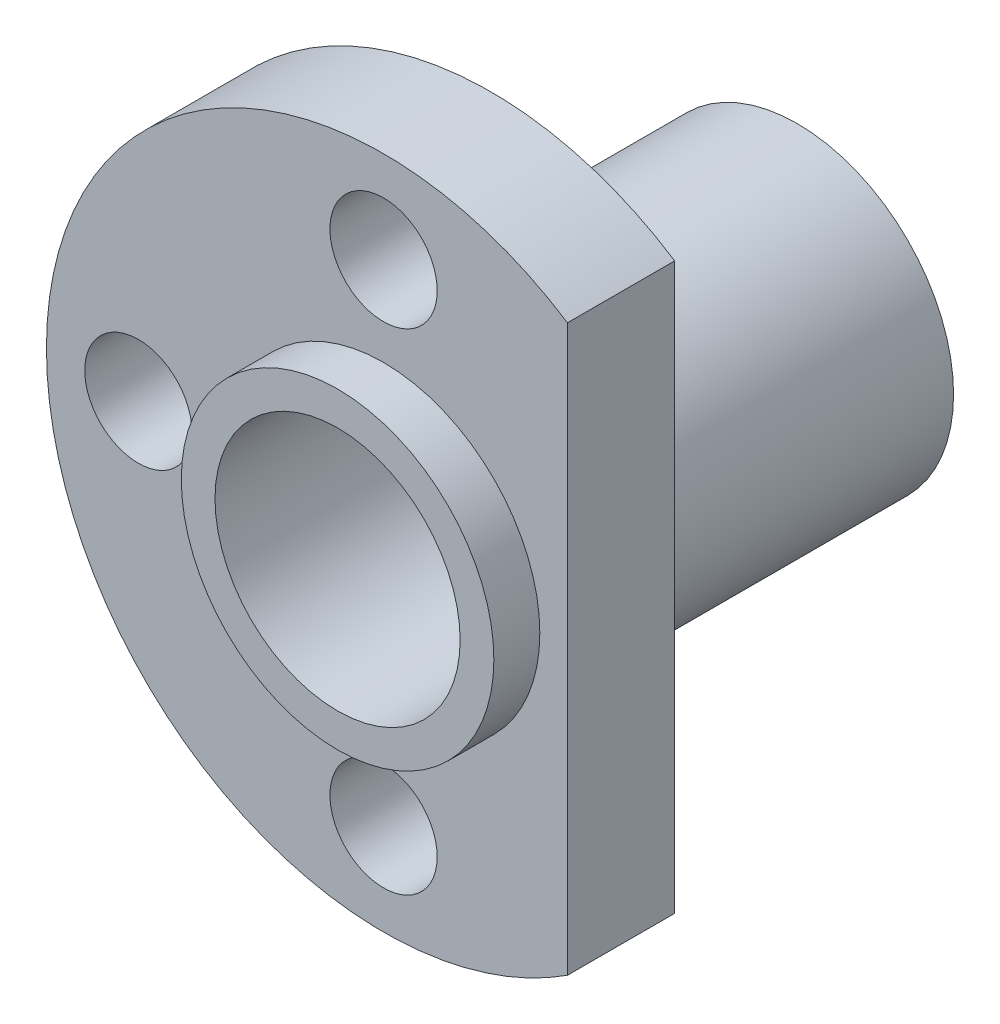
ISO-10303-21;
HEADER;
FILE_DESCRIPTION(('STEP AP214'),'2;1');
FILE_NAME('part.step','',(''),(''),'','','');
FILE_SCHEMA(('AUTOMOTIVE_DESIGN { 1 0 10303 214 1 1 1 1 }'));
ENDSEC;
DATA;
#1=APPLICATION_CONTEXT('core data for automotive mechanical design processes');
#2=APPLICATION_PROTOCOL_DEFINITION('international standard','automotive_design',2000,#1);
#3=PRODUCT_CONTEXT('',#1,'mechanical');
#4=PRODUCT('Part','Part','',(#3));
#5=PRODUCT_RELATED_PRODUCT_CATEGORY('part','',(#4));
#6=PRODUCT_DEFINITION_FORMATION('','',#4);
#7=PRODUCT_DEFINITION_CONTEXT('part definition',#1,'design');
#8=PRODUCT_DEFINITION('design','',#6,#7);
#9=PRODUCT_DEFINITION_SHAPE('','',#8);
#10=(LENGTH_UNIT() NAMED_UNIT(*) SI_UNIT(.MILLI.,.METRE.));
#11=(NAMED_UNIT(*) PLANE_ANGLE_UNIT() SI_UNIT($,.RADIAN.));
#12=(NAMED_UNIT(*) SI_UNIT($,.STERADIAN.) SOLID_ANGLE_UNIT());
#13=UNCERTAINTY_MEASURE_WITH_UNIT(LENGTH_MEASURE(1.E-05),#10,'distance_accuracy_value','');
#14=(GEOMETRIC_REPRESENTATION_CONTEXT(3) GLOBAL_UNCERTAINTY_ASSIGNED_CONTEXT((#13)) GLOBAL_UNIT_ASSIGNED_CONTEXT((#10,
#11,#12)) REPRESENTATION_CONTEXT('',''));
#15=CARTESIAN_POINT('',(0.,0.,0.));
#16=DIRECTION('',(0.,0.,1.));
#17=DIRECTION('',(1.,0.,0.));
#18=AXIS2_PLACEMENT_3D('',#15,#16,#17);
#19=CARTESIAN_POINT('',(0.,0.,-3.5));
#20=DIRECTION('',(0.,0.,1.));
#21=DIRECTION('',(1.,0.,0.));
#22=AXIS2_PLACEMENT_3D('',#19,#20,#21);
#23=CYLINDRICAL_SURFACE('',#22,11.);
#24=DIRECTION('',(0.,0.,1.));
#25=VECTOR('',#24,1.);
#26=CARTESIAN_POINT('',(6.,-9.21954445729289,-3.5));
#27=LINE('',#26,#25);
#28=CARTESIAN_POINT('',(6.,-9.21954445729289,0.));
#29=VERTEX_POINT('',#28);
#30=CARTESIAN_POINT('',(6.,-9.21954445729289,-3.5));
#31=VERTEX_POINT('',#30);
#32=EDGE_CURVE('E54',#29,#31,#27,.F.);
#33=ORIENTED_EDGE('',*,*,#32,.F.);
#34=CARTESIAN_POINT('',(0.,0.,0.));
#35=DIRECTION('',(0.,0.,1.));
#36=DIRECTION('',(1.,0.,0.));
#37=AXIS2_PLACEMENT_3D('',#34,#35,#36);
#38=CIRCLE('',#37,11.);
#39=CARTESIAN_POINT('',(6.,9.21954445729289,0.));
#40=VERTEX_POINT('',#39);
#41=EDGE_CURVE('E38',#40,#29,#38,.T.);
#42=ORIENTED_EDGE('',*,*,#41,.F.);
#43=DIRECTION('',(0.,0.,1.));
#44=VECTOR('',#43,1.);
#45=CARTESIAN_POINT('',(6.,9.21954445729289,-3.5));
#46=LINE('',#45,#44);
#47=CARTESIAN_POINT('',(6.,9.21954445729289,-3.5));
#48=VERTEX_POINT('',#47);
#49=EDGE_CURVE('E49',#48,#40,#46,.T.);
#50=ORIENTED_EDGE('',*,*,#49,.F.);
#51=CARTESIAN_POINT('',(0.,0.,-3.5));
#52=DIRECTION('',(0.,0.,1.));
#53=DIRECTION('',(1.,0.,0.));
#54=AXIS2_PLACEMENT_3D('',#51,#52,#53);
#55=CIRCLE('',#54,11.);
#56=EDGE_CURVE('E11',#48,#31,#55,.T.);
#57=ORIENTED_EDGE('',*,*,#56,.T.);
#58=EDGE_LOOP('',(#33,#42,#50,#57));
#59=FACE_BOUND('',#58,.T.);
#60=ADVANCED_FACE('F35',(#59),#23,.T.);
#61=CARTESIAN_POINT('',(0.,0.,-3.5));
#62=DIRECTION('',(0.,0.,1.));
#63=DIRECTION('',(1.,0.,0.));
#64=AXIS2_PLACEMENT_3D('',#61,#62,#63);
#65=PLANE('',#64);
#66=CARTESIAN_POINT('',(-7.99999999999977,-2.27373675443232E-13,-3.5));
#67=DIRECTION('',(0.,0.,1.));
#68=DIRECTION('',(1.,0.,0.));
#69=AXIS2_PLACEMENT_3D('',#66,#67,#68);
#70=CIRCLE('',#69,1.75000000000036);
#71=CARTESIAN_POINT('',(-6.24999999999941,-2.27373675443232E-13,-3.5));
#72=VERTEX_POINT('',#71);
#73=EDGE_CURVE('E88',#72,#72,#70,.T.);
#74=ORIENTED_EDGE('',*,*,#73,.T.);
#75=EDGE_LOOP('',(#74));
#76=FACE_BOUND('',#75,.T.);
#77=CARTESIAN_POINT('',(4.52787916007828E-13,-8.,-3.5));
#78=DIRECTION('',(0.,0.,1.));
#79=DIRECTION('',(1.,0.,0.));
#80=AXIS2_PLACEMENT_3D('',#77,#78,#79);
#81=CIRCLE('',#80,1.75000000000049);
#82=CARTESIAN_POINT('',(1.75000000000094,-8.,-3.5));
#83=VERTEX_POINT('',#82);
#84=EDGE_CURVE('E83',#83,#83,#81,.T.);
#85=ORIENTED_EDGE('',*,*,#84,.T.);
#86=EDGE_LOOP('',(#85));
#87=FACE_BOUND('',#86,.T.);
#88=CARTESIAN_POINT('',(0.,8.,-3.5));
#89=DIRECTION('',(0.,0.,1.));
#90=DIRECTION('',(1.,0.,0.));
#91=AXIS2_PLACEMENT_3D('',#88,#89,#90);
#92=CIRCLE('',#91,1.75);
#93=CARTESIAN_POINT('',(1.75,8.,-3.5));
#94=VERTEX_POINT('',#93);
#95=EDGE_CURVE('E74',#94,#94,#92,.T.);
#96=ORIENTED_EDGE('',*,*,#95,.T.);
#97=EDGE_LOOP('',(#96));
#98=FACE_BOUND('',#97,.T.);
#99=CARTESIAN_POINT('',(0.,0.,-3.5));
#100=DIRECTION('',(0.,0.,1.));
#101=DIRECTION('',(1.,0.,0.));
#102=AXIS2_PLACEMENT_3D('',#99,#100,#101);
#103=CIRCLE('',#102,5.1);
#104=CARTESIAN_POINT('',(5.1,0.,-3.5));
#105=VERTEX_POINT('',#104);
#106=EDGE_CURVE('E94',#105,#105,#103,.T.);
#107=ORIENTED_EDGE('',*,*,#106,.T.);
#108=EDGE_LOOP('',(#107));
#109=FACE_BOUND('',#108,.T.);
#110=ORIENTED_EDGE('',*,*,#56,.F.);
#111=DIRECTION('',(0.,-1.,0.));
#112=VECTOR('',#111,1.);
#113=CARTESIAN_POINT('',(6.,0.,-3.5));
#114=LINE('',#113,#112);
#115=EDGE_CURVE('E64',#48,#31,#114,.T.);
#116=ORIENTED_EDGE('',*,*,#115,.T.);
#117=EDGE_LOOP('',(#110,#116));
#118=FACE_BOUND('',#117,.T.);
#119=ADVANCED_FACE('F112',(#76,#87,#98,#109,#118),#65,.F.);
#120=CARTESIAN_POINT('',(0.,0.,0.));
#121=DIRECTION('',(0.,0.,1.));
#122=DIRECTION('',(1.,0.,0.));
#123=AXIS2_PLACEMENT_3D('',#120,#121,#122);
#124=PLANE('',#123);
#125=DIRECTION('',(0.,-1.,0.));
#126=VECTOR('',#125,1.);
#127=CARTESIAN_POINT('',(6.,12.3842532056717,0.));
#128=LINE('',#127,#126);
#129=EDGE_CURVE('E59',#40,#29,#128,.T.);
#130=ORIENTED_EDGE('',*,*,#129,.F.);
#131=ORIENTED_EDGE('',*,*,#41,.T.);
#132=EDGE_LOOP('',(#130,#131));
#133=FACE_BOUND('',#132,.T.);
#134=CARTESIAN_POINT('',(-7.99999999999977,-2.27373675443232E-13,0.));
#135=DIRECTION('',(0.,0.,1.));
#136=DIRECTION('',(1.,0.,0.));
#137=AXIS2_PLACEMENT_3D('',#134,#135,#136);
#138=CIRCLE('',#137,1.75000000000036);
#139=CARTESIAN_POINT('',(-6.24999999999941,-2.27373675443232E-13,0.));
#140=VERTEX_POINT('',#139);
#141=EDGE_CURVE('E91',#140,#140,#138,.T.);
#142=ORIENTED_EDGE('',*,*,#141,.F.);
#143=EDGE_LOOP('',(#142));
#144=FACE_BOUND('',#143,.T.);
#145=CARTESIAN_POINT('',(4.52787916007828E-13,-8.,0.));
#146=DIRECTION('',(0.,0.,1.));
#147=DIRECTION('',(1.,0.,0.));
#148=AXIS2_PLACEMENT_3D('',#145,#146,#147);
#149=CIRCLE('',#148,1.75000000000049);
#150=CARTESIAN_POINT('',(1.75000000000094,-8.,0.));
#151=VERTEX_POINT('',#150);
#152=EDGE_CURVE('E85',#151,#151,#149,.T.);
#153=ORIENTED_EDGE('',*,*,#152,.F.);
#154=EDGE_LOOP('',(#153));
#155=FACE_BOUND('',#154,.T.);
#156=CARTESIAN_POINT('',(0.,8.,0.));
#157=DIRECTION('',(0.,0.,1.));
#158=DIRECTION('',(1.,0.,0.));
#159=AXIS2_PLACEMENT_3D('',#156,#157,#158);
#160=CIRCLE('',#159,1.75);
#161=CARTESIAN_POINT('',(1.75,8.,0.));
#162=VERTEX_POINT('',#161);
#163=EDGE_CURVE('E79',#162,#162,#160,.T.);
#164=ORIENTED_EDGE('',*,*,#163,.F.);
#165=EDGE_LOOP('',(#164));
#166=FACE_BOUND('',#165,.T.);
#167=CARTESIAN_POINT('',(0.,0.,0.));
#168=DIRECTION('',(0.,0.,1.));
#169=DIRECTION('',(1.,0.,0.));
#170=AXIS2_PLACEMENT_3D('',#167,#168,#169);
#171=CIRCLE('',#170,5.1);
#172=CARTESIAN_POINT('',(5.1,0.,0.));
#173=VERTEX_POINT('',#172);
#174=EDGE_CURVE('E72',#173,#173,#171,.T.);
#175=ORIENTED_EDGE('',*,*,#174,.F.);
#176=EDGE_LOOP('',(#175));
#177=FACE_BOUND('',#176,.T.);
#178=ADVANCED_FACE('F70',(#133,#144,#155,#166,#177),#124,.T.);
#179=CARTESIAN_POINT('',(0.,8.,-3.5));
#180=DIRECTION('',(0.,0.,1.));
#181=DIRECTION('',(1.,0.,0.));
#182=AXIS2_PLACEMENT_3D('',#179,#180,#181);
#183=CYLINDRICAL_SURFACE('',#182,1.75);
#184=ORIENTED_EDGE('',*,*,#95,.F.);
#185=EDGE_LOOP('',(#184));
#186=FACE_BOUND('',#185,.T.);
#187=ORIENTED_EDGE('',*,*,#163,.T.);
#188=EDGE_LOOP('',(#187));
#189=FACE_BOUND('',#188,.T.);
#190=ADVANCED_FACE('F120',(#186,#189),#183,.F.);
#191=CARTESIAN_POINT('',(4.52787916007828E-13,-8.,-3.5));
#192=DIRECTION('',(0.,0.,1.));
#193=DIRECTION('',(1.,0.,0.));
#194=AXIS2_PLACEMENT_3D('',#191,#192,#193);
#195=CYLINDRICAL_SURFACE('',#194,1.75000000000049);
#196=ORIENTED_EDGE('',*,*,#84,.F.);
#197=EDGE_LOOP('',(#196));
#198=FACE_BOUND('',#197,.T.);
#199=ORIENTED_EDGE('',*,*,#152,.T.);
#200=EDGE_LOOP('',(#199));
#201=FACE_BOUND('',#200,.T.);
#202=ADVANCED_FACE('F125',(#198,#201),#195,.F.);
#203=CARTESIAN_POINT('',(-7.99999999999977,-2.27373675443232E-13,-3.5));
#204=DIRECTION('',(0.,0.,1.));
#205=DIRECTION('',(1.,0.,0.));
#206=AXIS2_PLACEMENT_3D('',#203,#204,#205);
#207=CYLINDRICAL_SURFACE('',#206,1.75000000000036);
#208=ORIENTED_EDGE('',*,*,#73,.F.);
#209=EDGE_LOOP('',(#208));
#210=FACE_BOUND('',#209,.T.);
#211=ORIENTED_EDGE('',*,*,#141,.T.);
#212=EDGE_LOOP('',(#211));
#213=FACE_BOUND('',#212,.T.);
#214=ADVANCED_FACE('F129',(#210,#213),#207,.F.);
#215=CARTESIAN_POINT('',(0.,0.,-13.5));
#216=DIRECTION('',(0.,0.,1.));
#217=DIRECTION('',(1.,0.,0.));
#218=AXIS2_PLACEMENT_3D('',#215,#216,#217);
#219=CYLINDRICAL_SURFACE('',#218,5.1);
#220=CARTESIAN_POINT('',(0.,0.,-13.5));
#221=DIRECTION('',(0.,0.,1.));
#222=DIRECTION('',(1.,0.,0.));
#223=AXIS2_PLACEMENT_3D('',#220,#221,#222);
#224=CIRCLE('',#223,5.1);
#225=CARTESIAN_POINT('',(5.1,0.,-13.5));
#226=VERTEX_POINT('',#225);
#227=EDGE_CURVE('E99',#226,#226,#224,.T.);
#228=ORIENTED_EDGE('',*,*,#227,.T.);
#229=EDGE_LOOP('',(#228));
#230=FACE_BOUND('',#229,.T.);
#231=ORIENTED_EDGE('',*,*,#106,.F.);
#232=EDGE_LOOP('',(#231));
#233=FACE_BOUND('',#232,.T.);
#234=ADVANCED_FACE('F133',(#230,#233),#219,.T.);
#235=ORIENTED_EDGE('',*,*,#174,.T.);
#236=EDGE_LOOP('',(#235));
#237=FACE_BOUND('',#236,.T.);
#238=CARTESIAN_POINT('',(0.,0.,1.5));
#239=DIRECTION('',(0.,0.,1.));
#240=DIRECTION('',(1.,0.,0.));
#241=AXIS2_PLACEMENT_3D('',#238,#239,#240);
#242=CIRCLE('',#241,5.1);
#243=CARTESIAN_POINT('',(5.1,0.,1.5));
#244=VERTEX_POINT('',#243);
#245=EDGE_CURVE('E105',#244,#244,#242,.T.);
#246=ORIENTED_EDGE('',*,*,#245,.F.);
#247=EDGE_LOOP('',(#246));
#248=FACE_BOUND('',#247,.T.);
#249=ADVANCED_FACE('F135',(#237,#248),#219,.T.);
#250=CARTESIAN_POINT('',(0.,0.,-13.5));
#251=DIRECTION('',(0.,0.,1.));
#252=DIRECTION('',(1.,0.,0.));
#253=AXIS2_PLACEMENT_3D('',#250,#251,#252);
#254=PLANE('',#253);
#255=CARTESIAN_POINT('',(0.,0.,-13.5));
#256=DIRECTION('',(0.,0.,1.));
#257=DIRECTION('',(1.,0.,0.));
#258=AXIS2_PLACEMENT_3D('',#255,#256,#257);
#259=CIRCLE('',#258,4.);
#260=CARTESIAN_POINT('',(4.,0.,-13.5));
#261=VERTEX_POINT('',#260);
#262=EDGE_CURVE('E102',#261,#261,#259,.T.);
#263=ORIENTED_EDGE('',*,*,#262,.T.);
#264=EDGE_LOOP('',(#263));
#265=FACE_BOUND('',#264,.T.);
#266=ORIENTED_EDGE('',*,*,#227,.F.);
#267=EDGE_LOOP('',(#266));
#268=FACE_BOUND('',#267,.T.);
#269=ADVANCED_FACE('F138',(#265,#268),#254,.F.);
#270=CARTESIAN_POINT('',(0.,0.,-13.5));
#271=DIRECTION('',(0.,0.,1.));
#272=DIRECTION('',(1.,0.,0.));
#273=AXIS2_PLACEMENT_3D('',#270,#271,#272);
#274=CYLINDRICAL_SURFACE('',#273,4.);
#275=ORIENTED_EDGE('',*,*,#262,.F.);
#276=EDGE_LOOP('',(#275));
#277=FACE_BOUND('',#276,.T.);
#278=CARTESIAN_POINT('',(0.,0.,1.5));
#279=DIRECTION('',(0.,0.,1.));
#280=DIRECTION('',(1.,0.,0.));
#281=AXIS2_PLACEMENT_3D('',#278,#279,#280);
#282=CIRCLE('',#281,4.);
#283=CARTESIAN_POINT('',(4.,0.,1.5));
#284=VERTEX_POINT('',#283);
#285=EDGE_CURVE('E68',#284,#284,#282,.T.);
#286=ORIENTED_EDGE('',*,*,#285,.T.);
#287=EDGE_LOOP('',(#286));
#288=FACE_BOUND('',#287,.T.);
#289=ADVANCED_FACE('F141',(#277,#288),#274,.F.);
#290=CARTESIAN_POINT('',(0.,0.,1.5));
#291=DIRECTION('',(0.,0.,1.));
#292=DIRECTION('',(1.,0.,0.));
#293=AXIS2_PLACEMENT_3D('',#290,#291,#292);
#294=PLANE('',#293);
#295=ORIENTED_EDGE('',*,*,#245,.T.);
#296=EDGE_LOOP('',(#295));
#297=FACE_BOUND('',#296,.T.);
#298=ORIENTED_EDGE('',*,*,#285,.F.);
#299=EDGE_LOOP('',(#298));
#300=FACE_BOUND('',#299,.T.);
#301=ADVANCED_FACE('F145',(#297,#300),#294,.T.);
#302=CARTESIAN_POINT('',(6.,12.3842532056717,-13.5));
#303=DIRECTION('',(-1.,0.,0.));
#304=DIRECTION('',(0.,-1.,0.));
#305=AXIS2_PLACEMENT_3D('',#302,#303,#304);
#306=PLANE('',#305);
#307=ORIENTED_EDGE('',*,*,#32,.T.);
#308=ORIENTED_EDGE('',*,*,#115,.F.);
#309=ORIENTED_EDGE('',*,*,#49,.T.);
#310=ORIENTED_EDGE('',*,*,#129,.T.);
#311=EDGE_LOOP('',(#307,#308,#309,#310));
#312=FACE_BOUND('',#311,.T.);
#313=ADVANCED_FACE('F60',(#312),#306,.F.);
#314=CLOSED_SHELL('',(#60,#119,#178,#190,#202,#214,#234,#249,#269,#289,#301,#313));
#315=MANIFOLD_SOLID_BREP('B2',#314);
#316=ADVANCED_BREP_SHAPE_REPRESENTATION('',(#18,#315),#14);
#317=SHAPE_DEFINITION_REPRESENTATION(#9,#316);
ENDSEC;
END-ISO-10303-21;
